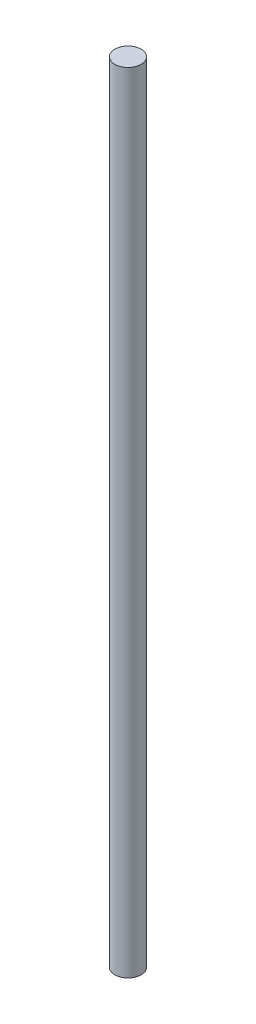
ISO-10303-21;
HEADER;
FILE_DESCRIPTION(('STEP AP214'),'2;1');
FILE_NAME('part.step','',(''),(''),'','','');
FILE_SCHEMA(('AUTOMOTIVE_DESIGN { 1 0 10303 214 1 1 1 1 }'));
ENDSEC;
DATA;
#1=APPLICATION_CONTEXT('core data for automotive mechanical design processes');
#2=APPLICATION_PROTOCOL_DEFINITION('international standard','automotive_design',2000,#1);
#3=PRODUCT_CONTEXT('',#1,'mechanical');
#4=PRODUCT('Part','Part','',(#3));
#5=PRODUCT_RELATED_PRODUCT_CATEGORY('part','',(#4));
#6=PRODUCT_DEFINITION_FORMATION('','',#4);
#7=PRODUCT_DEFINITION_CONTEXT('part definition',#1,'design');
#8=PRODUCT_DEFINITION('design','',#6,#7);
#9=PRODUCT_DEFINITION_SHAPE('','',#8);
#10=(LENGTH_UNIT() NAMED_UNIT(*) SI_UNIT(.MILLI.,.METRE.));
#11=(NAMED_UNIT(*) PLANE_ANGLE_UNIT() SI_UNIT($,.RADIAN.));
#12=(NAMED_UNIT(*) SI_UNIT($,.STERADIAN.) SOLID_ANGLE_UNIT());
#13=UNCERTAINTY_MEASURE_WITH_UNIT(LENGTH_MEASURE(1.E-05),#10,'distance_accuracy_value','');
#14=(GEOMETRIC_REPRESENTATION_CONTEXT(3) GLOBAL_UNCERTAINTY_ASSIGNED_CONTEXT((#13)) GLOBAL_UNIT_ASSIGNED_CONTEXT((#10,
#11,#12)) REPRESENTATION_CONTEXT('',''));
#15=CARTESIAN_POINT('',(0.,0.,0.));
#16=DIRECTION('',(0.,0.,1.));
#17=DIRECTION('',(1.,0.,0.));
#18=AXIS2_PLACEMENT_3D('',#15,#16,#17);
#19=CARTESIAN_POINT('',(0.,15.,0.));
#20=DIRECTION('',(0.,-1.,0.));
#21=DIRECTION('',(0.,0.,-1.));
#22=AXIS2_PLACEMENT_3D('',#19,#20,#21);
#23=CYLINDRICAL_SURFACE('',#22,0.25);
#24=CARTESIAN_POINT('',(0.,15.,0.));
#25=DIRECTION('',(0.,1.,0.));
#26=DIRECTION('',(0.,0.,1.));
#27=AXIS2_PLACEMENT_3D('',#24,#25,#26);
#28=CIRCLE('',#27,0.25);
#29=CARTESIAN_POINT('',(0.,15.,0.25));
#30=VERTEX_POINT('',#29);
#31=EDGE_CURVE('E10',#30,#30,#28,.T.);
#32=ORIENTED_EDGE('',*,*,#31,.F.);
#33=EDGE_LOOP('',(#32));
#34=FACE_BOUND('',#33,.T.);
#35=CARTESIAN_POINT('',(0.,0.,0.));
#36=DIRECTION('',(0.,1.,0.));
#37=DIRECTION('',(0.,0.,1.));
#38=AXIS2_PLACEMENT_3D('',#35,#36,#37);
#39=CIRCLE('',#38,0.25);
#40=CARTESIAN_POINT('',(0.,0.,0.25));
#41=VERTEX_POINT('',#40);
#42=EDGE_CURVE('E39',#41,#41,#39,.T.);
#43=ORIENTED_EDGE('',*,*,#42,.T.);
#44=EDGE_LOOP('',(#43));
#45=FACE_BOUND('',#44,.T.);
#46=ADVANCED_FACE('F36',(#34,#45),#23,.T.);
#47=CARTESIAN_POINT('',(0.,15.,0.));
#48=DIRECTION('',(0.,1.,0.));
#49=DIRECTION('',(0.,0.,1.));
#50=AXIS2_PLACEMENT_3D('',#47,#48,#49);
#51=PLANE('',#50);
#52=ORIENTED_EDGE('',*,*,#31,.T.);
#53=EDGE_LOOP('',(#52));
#54=FACE_BOUND('',#53,.T.);
#55=ADVANCED_FACE('F51',(#54),#51,.T.);
#56=CARTESIAN_POINT('',(0.,0.,0.));
#57=DIRECTION('',(0.,1.,0.));
#58=DIRECTION('',(0.,0.,1.));
#59=AXIS2_PLACEMENT_3D('',#56,#57,#58);
#60=PLANE('',#59);
#61=ORIENTED_EDGE('',*,*,#42,.F.);
#62=EDGE_LOOP('',(#61));
#63=FACE_BOUND('',#62,.T.);
#64=ADVANCED_FACE('F49',(#63),#60,.F.);
#65=CLOSED_SHELL('',(#46,#55,#64));
#66=MANIFOLD_SOLID_BREP('B2',#65);
#67=ADVANCED_BREP_SHAPE_REPRESENTATION('',(#18,#66),#14);
#68=SHAPE_DEFINITION_REPRESENTATION(#9,#67);
ENDSEC;
END-ISO-10303-21;
